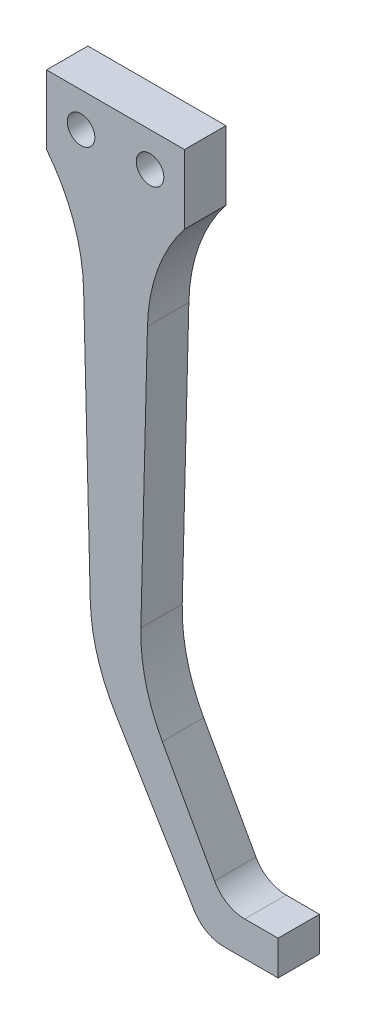
ISO-10303-21;
HEADER;
FILE_DESCRIPTION(('STEP AP214'),'2;1');
FILE_NAME('part.step','',(''),(''),'','','');
FILE_SCHEMA(('AUTOMOTIVE_DESIGN { 1 0 10303 214 1 1 1 1 }'));
ENDSEC;
DATA;
#1=APPLICATION_CONTEXT('core data for automotive mechanical design processes');
#2=APPLICATION_PROTOCOL_DEFINITION('international standard','automotive_design',2000,#1);
#3=PRODUCT_CONTEXT('',#1,'mechanical');
#4=PRODUCT('Part','Part','',(#3));
#5=PRODUCT_RELATED_PRODUCT_CATEGORY('part','',(#4));
#6=PRODUCT_DEFINITION_FORMATION('','',#4);
#7=PRODUCT_DEFINITION_CONTEXT('part definition',#1,'design');
#8=PRODUCT_DEFINITION('design','',#6,#7);
#9=PRODUCT_DEFINITION_SHAPE('','',#8);
#10=(LENGTH_UNIT() NAMED_UNIT(*) SI_UNIT(.MILLI.,.METRE.));
#11=(NAMED_UNIT(*) PLANE_ANGLE_UNIT() SI_UNIT($,.RADIAN.));
#12=(NAMED_UNIT(*) SI_UNIT($,.STERADIAN.) SOLID_ANGLE_UNIT());
#13=UNCERTAINTY_MEASURE_WITH_UNIT(LENGTH_MEASURE(1.E-05),#10,'distance_accuracy_value','');
#14=(GEOMETRIC_REPRESENTATION_CONTEXT(3) GLOBAL_UNCERTAINTY_ASSIGNED_CONTEXT((#13)) GLOBAL_UNIT_ASSIGNED_CONTEXT((#10,
#11,#12)) REPRESENTATION_CONTEXT('',''));
#15=CARTESIAN_POINT('',(0.,0.,0.));
#16=DIRECTION('',(0.,0.,1.));
#17=DIRECTION('',(1.,0.,0.));
#18=AXIS2_PLACEMENT_3D('',#15,#16,#17);
#19=CARTESIAN_POINT('',(0.,-87.2307621135331,6.));
#20=DIRECTION('',(0.,-1.,0.));
#21=DIRECTION('',(0.,0.,-1.));
#22=AXIS2_PLACEMENT_3D('',#19,#20,#21);
#23=PLANE('',#22);
#24=DIRECTION('',(-1.,0.,0.));
#25=VECTOR('',#24,1.);
#26=CARTESIAN_POINT('',(0.,-87.2307621135331,0.));
#27=LINE('',#26,#25);
#28=CARTESIAN_POINT('',(23.5614097231523,-87.2307621135331,0.));
#29=VERTEX_POINT('',#28);
#30=CARTESIAN_POINT('',(18.7334333782825,-87.2307621135331,0.));
#31=VERTEX_POINT('',#30);
#32=EDGE_CURVE('E228',#29,#31,#27,.T.);
#33=ORIENTED_EDGE('',*,*,#32,.T.);
#34=DIRECTION('',(0.,0.,-1.));
#35=VECTOR('',#34,1.);
#36=CARTESIAN_POINT('',(18.7334333782825,-87.2307621135331,6.));
#37=LINE('',#36,#35);
#38=CARTESIAN_POINT('',(18.7334333782825,-87.2307621135331,6.));
#39=VERTEX_POINT('',#38);
#40=EDGE_CURVE('E56',#31,#39,#37,.F.);
#41=ORIENTED_EDGE('',*,*,#40,.T.);
#42=DIRECTION('',(-1.,0.,0.));
#43=VECTOR('',#42,1.);
#44=CARTESIAN_POINT('',(0.,-87.2307621135331,6.));
#45=LINE('',#44,#43);
#46=CARTESIAN_POINT('',(23.5614097231523,-87.2307621135331,6.));
#47=VERTEX_POINT('',#46);
#48=EDGE_CURVE('E241',#47,#39,#45,.T.);
#49=ORIENTED_EDGE('',*,*,#48,.F.);
#50=DIRECTION('',(0.,0.,-1.));
#51=VECTOR('',#50,1.);
#52=CARTESIAN_POINT('',(23.5614097231523,-87.2307621135331,6.));
#53=LINE('',#52,#51);
#54=EDGE_CURVE('E234',#47,#29,#53,.T.);
#55=ORIENTED_EDGE('',*,*,#54,.T.);
#56=EDGE_LOOP('',(#33,#41,#49,#55));
#57=FACE_BOUND('',#56,.T.);
#58=ADVANCED_FACE('F35',(#57),#23,.F.);
#59=CARTESIAN_POINT('',(-24.8338215038537,-13.7220093127288,6.));
#60=DIRECTION('',(-0.875270549868654,-0.483633605669234,0.));
#61=DIRECTION('',(0.483633605669234,-0.875270549868654,0.));
#62=AXIS2_PLACEMENT_3D('',#59,#60,#61);
#63=PLANE('',#62);
#64=DIRECTION('',(-0.483633605669234,0.875270549868654,0.));
#65=VECTOR('',#64,1.);
#66=CARTESIAN_POINT('',(-24.8338215038537,-13.7220093127288,6.));
#67=LINE('',#66,#65);
#68=CARTESIAN_POINT('',(14.3570806289393,-84.6489301418793,6.));
#69=VERTEX_POINT('',#68);
#70=CARTESIAN_POINT('',(6.77992016762672,-70.9359347551364,6.));
#71=VERTEX_POINT('',#70);
#72=EDGE_CURVE('E238',#69,#71,#67,.T.);
#73=ORIENTED_EDGE('',*,*,#72,.F.);
#74=DIRECTION('',(0.,0.,-1.));
#75=VECTOR('',#74,1.);
#76=CARTESIAN_POINT('',(14.3570806289393,-84.6489301418793,0.));
#77=LINE('',#76,#75);
#78=CARTESIAN_POINT('',(14.3570806289393,-84.6489301418793,0.));
#79=VERTEX_POINT('',#78);
#80=EDGE_CURVE('E218',#69,#79,#77,.T.);
#81=ORIENTED_EDGE('',*,*,#80,.T.);
#82=DIRECTION('',(-0.483633605669234,0.875270549868654,0.));
#83=VECTOR('',#82,1.);
#84=CARTESIAN_POINT('',(-24.8338215038537,-13.7220093127288,0.));
#85=LINE('',#84,#83);
#86=CARTESIAN_POINT('',(6.77992016762672,-70.9359347551364,0.));
#87=VERTEX_POINT('',#86);
#88=EDGE_CURVE('E229',#79,#87,#85,.T.);
#89=ORIENTED_EDGE('',*,*,#88,.T.);
#90=DIRECTION('',(0.,0.,-1.));
#91=VECTOR('',#90,1.);
#92=CARTESIAN_POINT('',(6.77992016762672,-70.9359347551363,6.));
#93=LINE('',#92,#91);
#94=EDGE_CURVE('E197',#87,#71,#93,.F.);
#95=ORIENTED_EDGE('',*,*,#94,.T.);
#96=EDGE_LOOP('',(#73,#81,#89,#95));
#97=FACE_BOUND('',#96,.T.);
#98=ADVANCED_FACE('F237',(#97),#63,.F.);
#99=CARTESIAN_POINT('',(5.12179887570269,-0.128044971892567,6.));
#100=DIRECTION('',(-0.999687646408123,0.0249921911602029,0.));
#101=DIRECTION('',(-0.024992191160203,-0.999687646408123,0.));
#102=AXIS2_PLACEMENT_3D('',#99,#100,#101);
#103=PLANE('',#102);
#104=DIRECTION('',(0.024992191160203,0.999687646408123,0.));
#105=VECTOR('',#104,1.);
#106=CARTESIAN_POINT('',(5.12179887570269,-0.128044971892567,0.));
#107=LINE('',#106,#105);
#108=CARTESIAN_POINT('',(3.66949275414,-58.2202898344005,0.));
#109=VERTEX_POINT('',#108);
#110=CARTESIAN_POINT('',(4.62829222900821,-19.8683108396716,0.));
#111=VERTEX_POINT('',#110);
#112=EDGE_CURVE('E266',#109,#111,#107,.T.);
#113=ORIENTED_EDGE('',*,*,#112,.T.);
#114=DIRECTION('',(0.,0.,-1.));
#115=VECTOR('',#114,1.);
#116=CARTESIAN_POINT('',(4.62829222900821,-19.8683108396716,6.));
#117=LINE('',#116,#115);
#118=CARTESIAN_POINT('',(4.62829222900821,-19.8683108396716,6.));
#119=VERTEX_POINT('',#118);
#120=EDGE_CURVE('E177',#111,#119,#117,.F.);
#121=ORIENTED_EDGE('',*,*,#120,.T.);
#122=DIRECTION('',(0.024992191160203,0.999687646408123,0.));
#123=VECTOR('',#122,1.);
#124=CARTESIAN_POINT('',(5.12179887570269,-0.128044971892567,6.));
#125=LINE('',#124,#123);
#126=CARTESIAN_POINT('',(3.66949275414,-58.2202898344005,6.));
#127=VERTEX_POINT('',#126);
#128=EDGE_CURVE('E157',#127,#119,#125,.T.);
#129=ORIENTED_EDGE('',*,*,#128,.F.);
#130=DIRECTION('',(0.,0.,-1.));
#131=VECTOR('',#130,1.);
#132=CARTESIAN_POINT('',(3.66949275414,-58.2202898344004,0.));
#133=LINE('',#132,#131);
#134=EDGE_CURVE('E174',#127,#109,#133,.T.);
#135=ORIENTED_EDGE('',*,*,#134,.T.);
#136=EDGE_LOOP('',(#113,#121,#129,#135));
#137=FACE_BOUND('',#136,.T.);
#138=ADVANCED_FACE('F308',(#137),#103,.F.);
#139=CARTESIAN_POINT('',(10.,0.,6.));
#140=DIRECTION('',(1.,0.,0.));
#141=DIRECTION('',(0.,1.,0.));
#142=AXIS2_PLACEMENT_3D('',#139,#140,#141);
#143=PLANE('',#142);
#144=DIRECTION('',(0.,-1.,0.));
#145=VECTOR('',#144,1.);
#146=CARTESIAN_POINT('',(10.,0.,0.));
#147=LINE('',#146,#145);
#148=CARTESIAN_POINT('',(10.,5.,0.));
#149=VERTEX_POINT('',#148);
#150=CARTESIAN_POINT('',(10.,-5.,0.));
#151=VERTEX_POINT('',#150);
#152=EDGE_CURVE('E269',#149,#151,#147,.T.);
#153=ORIENTED_EDGE('',*,*,#152,.F.);
#154=DIRECTION('',(0.,0.,-1.));
#155=VECTOR('',#154,1.);
#156=CARTESIAN_POINT('',(10.,5.,6.));
#157=LINE('',#156,#155);
#158=CARTESIAN_POINT('',(10.,5.,6.));
#159=VERTEX_POINT('',#158);
#160=EDGE_CURVE('E170',#159,#149,#157,.T.);
#161=ORIENTED_EDGE('',*,*,#160,.F.);
#162=DIRECTION('',(0.,-1.,0.));
#163=VECTOR('',#162,1.);
#164=CARTESIAN_POINT('',(10.,0.,6.));
#165=LINE('',#164,#163);
#166=CARTESIAN_POINT('',(10.,-5.,6.));
#167=VERTEX_POINT('',#166);
#168=EDGE_CURVE('E154',#159,#167,#165,.T.);
#169=ORIENTED_EDGE('',*,*,#168,.T.);
#170=DIRECTION('',(0.,0.,-1.));
#171=VECTOR('',#170,1.);
#172=CARTESIAN_POINT('',(10.,-5.,6.));
#173=LINE('',#172,#171);
#174=EDGE_CURVE('E168',#167,#151,#173,.T.);
#175=ORIENTED_EDGE('',*,*,#174,.T.);
#176=EDGE_LOOP('',(#153,#161,#169,#175));
#177=FACE_BOUND('',#176,.T.);
#178=ADVANCED_FACE('F167',(#177),#143,.T.);
#179=CARTESIAN_POINT('',(0.,5.,6.));
#180=DIRECTION('',(0.,1.,0.));
#181=DIRECTION('',(0.,0.,1.));
#182=AXIS2_PLACEMENT_3D('',#179,#180,#181);
#183=PLANE('',#182);
#184=DIRECTION('',(1.,0.,0.));
#185=VECTOR('',#184,1.);
#186=CARTESIAN_POINT('',(0.,5.,0.));
#187=LINE('',#186,#185);
#188=CARTESIAN_POINT('',(-10.,5.,0.));
#189=VERTEX_POINT('',#188);
#190=EDGE_CURVE('E271',#189,#149,#187,.T.);
#191=ORIENTED_EDGE('',*,*,#190,.F.);
#192=DIRECTION('',(0.,0.,-1.));
#193=VECTOR('',#192,1.);
#194=CARTESIAN_POINT('',(-10.,5.,6.));
#195=LINE('',#194,#193);
#196=CARTESIAN_POINT('',(-10.,5.,6.));
#197=VERTEX_POINT('',#196);
#198=EDGE_CURVE('E179',#197,#189,#195,.T.);
#199=ORIENTED_EDGE('',*,*,#198,.F.);
#200=DIRECTION('',(1.,0.,0.));
#201=VECTOR('',#200,1.);
#202=CARTESIAN_POINT('',(0.,5.,6.));
#203=LINE('',#202,#201);
#204=EDGE_CURVE('E171',#197,#159,#203,.T.);
#205=ORIENTED_EDGE('',*,*,#204,.T.);
#206=ORIENTED_EDGE('',*,*,#160,.T.);
#207=EDGE_LOOP('',(#191,#199,#205,#206));
#208=FACE_BOUND('',#207,.T.);
#209=ADVANCED_FACE('F305',(#208),#183,.T.);
#210=CARTESIAN_POINT('',(-10.,0.,6.));
#211=DIRECTION('',(1.,0.,0.));
#212=DIRECTION('',(0.,1.,0.));
#213=AXIS2_PLACEMENT_3D('',#210,#211,#212);
#214=PLANE('',#213);
#215=DIRECTION('',(0.,-1.,0.));
#216=VECTOR('',#215,1.);
#217=CARTESIAN_POINT('',(-10.,0.,0.));
#218=LINE('',#217,#216);
#219=CARTESIAN_POINT('',(-10.,-5.,0.));
#220=VERTEX_POINT('',#219);
#221=EDGE_CURVE('E274',#189,#220,#218,.T.);
#222=ORIENTED_EDGE('',*,*,#221,.T.);
#223=DIRECTION('',(0.,0.,-1.));
#224=VECTOR('',#223,1.);
#225=CARTESIAN_POINT('',(-10.,-5.,6.));
#226=LINE('',#225,#224);
#227=CARTESIAN_POINT('',(-10.,-5.,6.));
#228=VERTEX_POINT('',#227);
#229=EDGE_CURVE('E295',#228,#220,#226,.T.);
#230=ORIENTED_EDGE('',*,*,#229,.F.);
#231=DIRECTION('',(0.,-1.,0.));
#232=VECTOR('',#231,1.);
#233=CARTESIAN_POINT('',(-10.,0.,6.));
#234=LINE('',#233,#232);
#235=EDGE_CURVE('E248',#197,#228,#234,.T.);
#236=ORIENTED_EDGE('',*,*,#235,.F.);
#237=ORIENTED_EDGE('',*,*,#198,.T.);
#238=EDGE_LOOP('',(#222,#230,#236,#237));
#239=FACE_BOUND('',#238,.T.);
#240=ADVANCED_FACE('F300',(#239),#214,.F.);
#241=CARTESIAN_POINT('',(-5.12179887570269,-0.128044971892568,6.));
#242=DIRECTION('',(0.999687646408123,0.0249921911602032,0.));
#243=DIRECTION('',(-0.0249921911602032,0.999687646408123,0.));
#244=AXIS2_PLACEMENT_3D('',#241,#242,#243);
#245=PLANE('',#244);
#246=DIRECTION('',(0.0249921911602032,-0.999687646408123,0.));
#247=VECTOR('',#246,1.);
#248=CARTESIAN_POINT('',(-5.12179887570269,-0.128044971892568,6.));
#249=LINE('',#248,#247);
#250=CARTESIAN_POINT('',(-4.62829222900821,-19.8683108396716,6.));
#251=VERTEX_POINT('',#250);
#252=CARTESIAN_POINT('',(-3.66465021140004,-58.413991543998,6.));
#253=VERTEX_POINT('',#252);
#254=EDGE_CURVE('E250',#251,#253,#249,.T.);
#255=ORIENTED_EDGE('',*,*,#254,.F.);
#256=DIRECTION('',(0.,0.,-1.));
#257=VECTOR('',#256,1.);
#258=CARTESIAN_POINT('',(-4.62829222900821,-19.8683108396716,6.));
#259=LINE('',#258,#257);
#260=CARTESIAN_POINT('',(-4.62829222900821,-19.8683108396716,0.));
#261=VERTEX_POINT('',#260);
#262=EDGE_CURVE('E186',#251,#261,#259,.T.);
#263=ORIENTED_EDGE('',*,*,#262,.T.);
#264=DIRECTION('',(0.0249921911602032,-0.999687646408123,0.));
#265=VECTOR('',#264,1.);
#266=CARTESIAN_POINT('',(-5.12179887570269,-0.128044971892568,0.));
#267=LINE('',#266,#265);
#268=CARTESIAN_POINT('',(-3.66465021140004,-58.413991543998,0.));
#269=VERTEX_POINT('',#268);
#270=EDGE_CURVE('E277',#261,#269,#267,.T.);
#271=ORIENTED_EDGE('',*,*,#270,.T.);
#272=DIRECTION('',(0.,0.,-1.));
#273=VECTOR('',#272,1.);
#274=CARTESIAN_POINT('',(-3.66465021140004,-58.413991543998,6.));
#275=LINE('',#274,#273);
#276=EDGE_CURVE('E184',#269,#253,#275,.F.);
#277=ORIENTED_EDGE('',*,*,#276,.T.);
#278=EDGE_LOOP('',(#255,#263,#271,#277));
#279=FACE_BOUND('',#278,.T.);
#280=ADVANCED_FACE('F343',(#279),#245,.F.);
#281=CARTESIAN_POINT('',(-31.2473849142956,-18.7443908452629,6.));
#282=DIRECTION('',(-0.857541837332092,-0.514414227277104,0.));
#283=DIRECTION('',(0.514414227277104,-0.857541837332092,0.));
#284=AXIS2_PLACEMENT_3D('',#281,#282,#283);
#285=PLANE('',#284);
#286=DIRECTION('',(-0.514414227277104,0.857541837332092,0.));
#287=VECTOR('',#286,1.);
#288=CARTESIAN_POINT('',(-31.2473849142956,-18.7443908452629,0.));
#289=LINE('',#288,#287);
#290=CARTESIAN_POINT('',(11.3784930893101,-89.8028332499187,0.));
#291=VERTEX_POINT('',#290);
#292=CARTESIAN_POINT('',(-0.111004984499258,-70.6495424469205,0.));
#293=VERTEX_POINT('',#292);
#294=EDGE_CURVE('E280',#291,#293,#289,.T.);
#295=ORIENTED_EDGE('',*,*,#294,.F.);
#296=DIRECTION('',(0.,0.,-1.));
#297=VECTOR('',#296,1.);
#298=CARTESIAN_POINT('',(11.3784930893101,-89.8028332499186,6.));
#299=LINE('',#298,#297);
#300=CARTESIAN_POINT('',(11.3784930893101,-89.8028332499187,6.));
#301=VERTEX_POINT('',#300);
#302=EDGE_CURVE('E214',#291,#301,#299,.F.);
#303=ORIENTED_EDGE('',*,*,#302,.T.);
#304=DIRECTION('',(-0.514414227277104,0.857541837332092,0.));
#305=VECTOR('',#304,1.);
#306=CARTESIAN_POINT('',(-31.2473849142956,-18.7443908452629,6.));
#307=LINE('',#306,#305);
#308=CARTESIAN_POINT('',(-0.111004984499258,-70.6495424469205,6.));
#309=VERTEX_POINT('',#308);
#310=EDGE_CURVE('E253',#301,#309,#307,.T.);
#311=ORIENTED_EDGE('',*,*,#310,.T.);
#312=DIRECTION('',(0.,0.,-1.));
#313=VECTOR('',#312,1.);
#314=CARTESIAN_POINT('',(-0.111004984499265,-70.6495424469205,0.));
#315=LINE('',#314,#313);
#316=EDGE_CURVE('E189',#309,#293,#315,.T.);
#317=ORIENTED_EDGE('',*,*,#316,.T.);
#318=EDGE_LOOP('',(#295,#303,#311,#317));
#319=FACE_BOUND('',#318,.T.);
#320=ADVANCED_FACE('F374',(#319),#285,.T.);
#321=CARTESIAN_POINT('',(0.,-92.2307621135331,6.));
#322=DIRECTION('',(0.,1.,0.));
#323=DIRECTION('',(0.,0.,1.));
#324=AXIS2_PLACEMENT_3D('',#321,#322,#323);
#325=PLANE('',#324);
#326=DIRECTION('',(1.,0.,0.));
#327=VECTOR('',#326,1.);
#328=CARTESIAN_POINT('',(0.,-92.2307621135331,6.));
#329=LINE('',#328,#327);
#330=CARTESIAN_POINT('',(15.6662022759705,-92.2307621135331,6.));
#331=VERTEX_POINT('',#330);
#332=CARTESIAN_POINT('',(23.5614097231523,-92.2307621135331,6.));
#333=VERTEX_POINT('',#332);
#334=EDGE_CURVE('E255',#331,#333,#329,.T.);
#335=ORIENTED_EDGE('',*,*,#334,.F.);
#336=DIRECTION('',(0.,0.,-1.));
#337=VECTOR('',#336,1.);
#338=CARTESIAN_POINT('',(15.6662022759705,-92.2307621135331,0.));
#339=LINE('',#338,#337);
#340=CARTESIAN_POINT('',(15.6662022759705,-92.2307621135331,0.));
#341=VERTEX_POINT('',#340);
#342=EDGE_CURVE('E209',#331,#341,#339,.T.);
#343=ORIENTED_EDGE('',*,*,#342,.T.);
#344=DIRECTION('',(1.,0.,0.));
#345=VECTOR('',#344,1.);
#346=CARTESIAN_POINT('',(0.,-92.2307621135331,0.));
#347=LINE('',#346,#345);
#348=CARTESIAN_POINT('',(23.5614097231523,-92.2307621135331,0.));
#349=VERTEX_POINT('',#348);
#350=EDGE_CURVE('E282',#341,#349,#347,.T.);
#351=ORIENTED_EDGE('',*,*,#350,.T.);
#352=DIRECTION('',(0.,0.,-1.));
#353=VECTOR('',#352,1.);
#354=CARTESIAN_POINT('',(23.5614097231523,-92.2307621135331,6.));
#355=LINE('',#354,#353);
#356=EDGE_CURVE('E292',#333,#349,#355,.T.);
#357=ORIENTED_EDGE('',*,*,#356,.F.);
#358=EDGE_LOOP('',(#335,#343,#351,#357));
#359=FACE_BOUND('',#358,.T.);
#360=ADVANCED_FACE('F353',(#359),#325,.F.);
#361=CARTESIAN_POINT('',(5.,0.,6.));
#362=DIRECTION('',(0.,0.,-1.));
#363=DIRECTION('',(-1.,0.,0.));
#364=AXIS2_PLACEMENT_3D('',#361,#362,#363);
#365=CYLINDRICAL_SURFACE('',#364,2.);
#366=CARTESIAN_POINT('',(5.,0.,6.));
#367=DIRECTION('',(0.,0.,1.));
#368=DIRECTION('',(1.,0.,0.));
#369=AXIS2_PLACEMENT_3D('',#366,#367,#368);
#370=CIRCLE('',#369,2.);
#371=CARTESIAN_POINT('',(7.,0.,6.));
#372=VERTEX_POINT('',#371);
#373=EDGE_CURVE('E259',#372,#372,#370,.T.);
#374=ORIENTED_EDGE('',*,*,#373,.T.);
#375=EDGE_LOOP('',(#374));
#376=FACE_BOUND('',#375,.T.);
#377=CARTESIAN_POINT('',(5.,0.,0.));
#378=DIRECTION('',(0.,0.,1.));
#379=DIRECTION('',(1.,0.,0.));
#380=AXIS2_PLACEMENT_3D('',#377,#378,#379);
#381=CIRCLE('',#380,2.);
#382=CARTESIAN_POINT('',(7.,0.,0.));
#383=VERTEX_POINT('',#382);
#384=EDGE_CURVE('E286',#383,#383,#381,.T.);
#385=ORIENTED_EDGE('',*,*,#384,.F.);
#386=EDGE_LOOP('',(#385));
#387=FACE_BOUND('',#386,.T.);
#388=ADVANCED_FACE('F361',(#376,#387),#365,.F.);
#389=CARTESIAN_POINT('',(23.5614097231523,0.,6.));
#390=DIRECTION('',(-1.,0.,0.));
#391=DIRECTION('',(0.,0.,1.));
#392=AXIS2_PLACEMENT_3D('',#389,#390,#391);
#393=PLANE('',#392);
#394=DIRECTION('',(0.,1.,0.));
#395=VECTOR('',#394,1.);
#396=CARTESIAN_POINT('',(23.5614097231523,0.,0.));
#397=LINE('',#396,#395);
#398=EDGE_CURVE('E284',#349,#29,#397,.T.);
#399=ORIENTED_EDGE('',*,*,#398,.T.);
#400=ORIENTED_EDGE('',*,*,#54,.F.);
#401=DIRECTION('',(0.,1.,0.));
#402=VECTOR('',#401,1.);
#403=CARTESIAN_POINT('',(23.5614097231523,0.,6.));
#404=LINE('',#403,#402);
#405=EDGE_CURVE('E257',#333,#47,#404,.T.);
#406=ORIENTED_EDGE('',*,*,#405,.F.);
#407=ORIENTED_EDGE('',*,*,#356,.T.);
#408=EDGE_LOOP('',(#399,#400,#406,#407));
#409=FACE_BOUND('',#408,.T.);
#410=ADVANCED_FACE('F357',(#409),#393,.F.);
#411=CARTESIAN_POINT('',(-5.,0.,6.));
#412=DIRECTION('',(0.,0.,-1.));
#413=DIRECTION('',(-1.,0.,0.));
#414=AXIS2_PLACEMENT_3D('',#411,#412,#413);
#415=CYLINDRICAL_SURFACE('',#414,2.);
#416=CARTESIAN_POINT('',(-5.,0.,6.));
#417=DIRECTION('',(0.,0.,1.));
#418=DIRECTION('',(1.,0.,0.));
#419=AXIS2_PLACEMENT_3D('',#416,#417,#418);
#420=CIRCLE('',#419,2.);
#421=CARTESIAN_POINT('',(-3.,0.,6.));
#422=VERTEX_POINT('',#421);
#423=EDGE_CURVE('E262',#422,#422,#420,.T.);
#424=ORIENTED_EDGE('',*,*,#423,.T.);
#425=EDGE_LOOP('',(#424));
#426=FACE_BOUND('',#425,.T.);
#427=CARTESIAN_POINT('',(-5.,0.,0.));
#428=DIRECTION('',(0.,0.,1.));
#429=DIRECTION('',(1.,0.,0.));
#430=AXIS2_PLACEMENT_3D('',#427,#428,#429);
#431=CIRCLE('',#430,2.);
#432=CARTESIAN_POINT('',(-3.,0.,0.));
#433=VERTEX_POINT('',#432);
#434=EDGE_CURVE('E244',#433,#433,#431,.T.);
#435=ORIENTED_EDGE('',*,*,#434,.F.);
#436=EDGE_LOOP('',(#435));
#437=FACE_BOUND('',#436,.T.);
#438=ADVANCED_FACE('F360',(#426,#437),#415,.F.);
#439=CARTESIAN_POINT('',(0.,0.,6.));
#440=DIRECTION('',(0.,0.,1.));
#441=DIRECTION('',(1.,0.,0.));
#442=AXIS2_PLACEMENT_3D('',#439,#440,#441);
#443=PLANE('',#442);
#444=ORIENTED_EDGE('',*,*,#310,.F.);
#445=CARTESIAN_POINT('',(15.6662022759705,-87.2307621135331,6.));
#446=DIRECTION('',(0.,0.,1.));
#447=DIRECTION('',(1.,0.,0.));
#448=AXIS2_PLACEMENT_3D('',#445,#446,#447);
#449=CIRCLE('',#448,5.);
#450=EDGE_CURVE('E216',#301,#331,#449,.T.);
#451=ORIENTED_EDGE('',*,*,#450,.T.);
#452=ORIENTED_EDGE('',*,*,#334,.T.);
#453=ORIENTED_EDGE('',*,*,#405,.T.);
#454=ORIENTED_EDGE('',*,*,#48,.T.);
#455=CARTESIAN_POINT('',(18.7334333782825,-82.2307621135331,6.));
#456=DIRECTION('',(0.,0.,1.));
#457=DIRECTION('',(1.,0.,0.));
#458=AXIS2_PLACEMENT_3D('',#455,#456,#457);
#459=CIRCLE('',#458,5.);
#460=EDGE_CURVE('E11',#39,#69,#459,.F.);
#461=ORIENTED_EDGE('',*,*,#460,.T.);
#462=ORIENTED_EDGE('',*,*,#72,.T.);
#463=CARTESIAN_POINT('',(28.6616839143431,-58.8450946134055,6.));
#464=DIRECTION('',(0.,0.,1.));
#465=DIRECTION('',(1.,0.,0.));
#466=AXIS2_PLACEMENT_3D('',#463,#464,#465);
#467=CIRCLE('',#466,25.);
#468=EDGE_CURVE('E207',#71,#127,#467,.F.);
#469=ORIENTED_EDGE('',*,*,#468,.T.);
#470=ORIENTED_EDGE('',*,*,#128,.T.);
#471=CARTESIAN_POINT('',(29.6204833892113,-20.4931156186767,6.));
#472=DIRECTION('',(0.,0.,1.));
#473=DIRECTION('',(1.,0.,0.));
#474=AXIS2_PLACEMENT_3D('',#471,#472,#473);
#475=CIRCLE('',#474,25.);
#476=EDGE_CURVE('E148',#119,#167,#475,.F.);
#477=ORIENTED_EDGE('',*,*,#476,.T.);
#478=ORIENTED_EDGE('',*,*,#168,.F.);
#479=ORIENTED_EDGE('',*,*,#204,.F.);
#480=ORIENTED_EDGE('',*,*,#235,.T.);
#481=CARTESIAN_POINT('',(-29.6204833892113,-20.4931156186767,6.));
#482=DIRECTION('',(0.,0.,1.));
#483=DIRECTION('',(1.,0.,0.));
#484=AXIS2_PLACEMENT_3D('',#481,#482,#483);
#485=CIRCLE('',#484,25.);
#486=EDGE_CURVE('E202',#228,#251,#485,.F.);
#487=ORIENTED_EDGE('',*,*,#486,.T.);
#488=ORIENTED_EDGE('',*,*,#254,.T.);
#489=CARTESIAN_POINT('',(21.327540948803,-57.7891867649929,6.));
#490=DIRECTION('',(0.,0.,1.));
#491=DIRECTION('',(1.,0.,0.));
#492=AXIS2_PLACEMENT_3D('',#489,#490,#491);
#493=CIRCLE('',#492,25.);
#494=EDGE_CURVE('E194',#253,#309,#493,.T.);
#495=ORIENTED_EDGE('',*,*,#494,.T.);
#496=EDGE_LOOP('',(#444,#451,#452,#453,#454,#461,#462,#469,#470,#477,#478,#479,#480,#487,#488,#495));
#497=FACE_BOUND('',#496,.T.);
#498=ORIENTED_EDGE('',*,*,#373,.F.);
#499=EDGE_LOOP('',(#498));
#500=FACE_BOUND('',#499,.T.);
#501=ORIENTED_EDGE('',*,*,#423,.F.);
#502=EDGE_LOOP('',(#501));
#503=FACE_BOUND('',#502,.T.);
#504=ADVANCED_FACE('F151',(#497,#500,#503),#443,.T.);
#505=CARTESIAN_POINT('',(0.,0.,0.));
#506=DIRECTION('',(0.,0.,1.));
#507=DIRECTION('',(1.,0.,0.));
#508=AXIS2_PLACEMENT_3D('',#505,#506,#507);
#509=PLANE('',#508);
#510=ORIENTED_EDGE('',*,*,#350,.F.);
#511=CARTESIAN_POINT('',(15.6662022759705,-87.2307621135331,0.));
#512=DIRECTION('',(0.,0.,1.));
#513=DIRECTION('',(1.,0.,0.));
#514=AXIS2_PLACEMENT_3D('',#511,#512,#513);
#515=CIRCLE('',#514,5.);
#516=EDGE_CURVE('E212',#341,#291,#515,.F.);
#517=ORIENTED_EDGE('',*,*,#516,.T.);
#518=ORIENTED_EDGE('',*,*,#294,.T.);
#519=CARTESIAN_POINT('',(21.327540948803,-57.7891867649929,0.));
#520=DIRECTION('',(0.,0.,1.));
#521=DIRECTION('',(1.,0.,0.));
#522=AXIS2_PLACEMENT_3D('',#519,#520,#521);
#523=CIRCLE('',#522,25.);
#524=EDGE_CURVE('E192',#293,#269,#523,.F.);
#525=ORIENTED_EDGE('',*,*,#524,.T.);
#526=ORIENTED_EDGE('',*,*,#270,.F.);
#527=CARTESIAN_POINT('',(-29.6204833892113,-20.4931156186767,0.));
#528=DIRECTION('',(0.,0.,1.));
#529=DIRECTION('',(1.,0.,0.));
#530=AXIS2_PLACEMENT_3D('',#527,#528,#529);
#531=CIRCLE('',#530,25.);
#532=EDGE_CURVE('E161',#261,#220,#531,.T.);
#533=ORIENTED_EDGE('',*,*,#532,.T.);
#534=ORIENTED_EDGE('',*,*,#221,.F.);
#535=ORIENTED_EDGE('',*,*,#190,.T.);
#536=ORIENTED_EDGE('',*,*,#152,.T.);
#537=CARTESIAN_POINT('',(29.6204833892113,-20.4931156186767,0.));
#538=DIRECTION('',(0.,0.,1.));
#539=DIRECTION('',(1.,0.,0.));
#540=AXIS2_PLACEMENT_3D('',#537,#538,#539);
#541=CIRCLE('',#540,25.);
#542=EDGE_CURVE('E162',#151,#111,#541,.T.);
#543=ORIENTED_EDGE('',*,*,#542,.T.);
#544=ORIENTED_EDGE('',*,*,#112,.F.);
#545=CARTESIAN_POINT('',(28.6616839143431,-58.8450946134055,0.));
#546=DIRECTION('',(0.,0.,1.));
#547=DIRECTION('',(1.,0.,0.));
#548=AXIS2_PLACEMENT_3D('',#545,#546,#547);
#549=CIRCLE('',#548,25.);
#550=EDGE_CURVE('E204',#109,#87,#549,.T.);
#551=ORIENTED_EDGE('',*,*,#550,.T.);
#552=ORIENTED_EDGE('',*,*,#88,.F.);
#553=CARTESIAN_POINT('',(18.7334333782825,-82.2307621135331,0.));
#554=DIRECTION('',(0.,0.,1.));
#555=DIRECTION('',(1.,0.,0.));
#556=AXIS2_PLACEMENT_3D('',#553,#554,#555);
#557=CIRCLE('',#556,5.);
#558=EDGE_CURVE('E43',#79,#31,#557,.T.);
#559=ORIENTED_EDGE('',*,*,#558,.T.);
#560=ORIENTED_EDGE('',*,*,#32,.F.);
#561=ORIENTED_EDGE('',*,*,#398,.F.);
#562=EDGE_LOOP('',(#510,#517,#518,#525,#526,#533,#534,#535,#536,#543,#544,#551,#552,#559,#560,#561));
#563=FACE_BOUND('',#562,.T.);
#564=ORIENTED_EDGE('',*,*,#384,.T.);
#565=EDGE_LOOP('',(#564));
#566=FACE_BOUND('',#565,.T.);
#567=ORIENTED_EDGE('',*,*,#434,.T.);
#568=EDGE_LOOP('',(#567));
#569=FACE_BOUND('',#568,.T.);
#570=ADVANCED_FACE('F225',(#563,#566,#569),#509,.F.);
#571=CARTESIAN_POINT('',(29.6204833892113,-20.4931156186767,6.));
#572=DIRECTION('',(0.,0.,-1.));
#573=DIRECTION('',(-1.,0.,0.));
#574=AXIS2_PLACEMENT_3D('',#571,#572,#573);
#575=CYLINDRICAL_SURFACE('',#574,25.);
#576=ORIENTED_EDGE('',*,*,#476,.F.);
#577=ORIENTED_EDGE('',*,*,#120,.F.);
#578=ORIENTED_EDGE('',*,*,#542,.F.);
#579=ORIENTED_EDGE('',*,*,#174,.F.);
#580=EDGE_LOOP('',(#576,#577,#578,#579));
#581=FACE_BOUND('',#580,.T.);
#582=ADVANCED_FACE('F173',(#581),#575,.F.);
#583=CARTESIAN_POINT('',(-29.6204833892113,-20.4931156186767,6.));
#584=DIRECTION('',(0.,0.,-1.));
#585=DIRECTION('',(-1.,0.,0.));
#586=AXIS2_PLACEMENT_3D('',#583,#584,#585);
#587=CYLINDRICAL_SURFACE('',#586,25.);
#588=ORIENTED_EDGE('',*,*,#486,.F.);
#589=ORIENTED_EDGE('',*,*,#229,.T.);
#590=ORIENTED_EDGE('',*,*,#532,.F.);
#591=ORIENTED_EDGE('',*,*,#262,.F.);
#592=EDGE_LOOP('',(#588,#589,#590,#591));
#593=FACE_BOUND('',#592,.T.);
#594=ADVANCED_FACE('F321',(#593),#587,.F.);
#595=CARTESIAN_POINT('',(21.327540948803,-57.7891867649929,6.));
#596=DIRECTION('',(0.,0.,1.));
#597=DIRECTION('',(1.,0.,0.));
#598=AXIS2_PLACEMENT_3D('',#595,#596,#597);
#599=CYLINDRICAL_SURFACE('',#598,25.);
#600=ORIENTED_EDGE('',*,*,#494,.F.);
#601=ORIENTED_EDGE('',*,*,#276,.F.);
#602=ORIENTED_EDGE('',*,*,#524,.F.);
#603=ORIENTED_EDGE('',*,*,#316,.F.);
#604=EDGE_LOOP('',(#600,#601,#602,#603));
#605=FACE_BOUND('',#604,.T.);
#606=ADVANCED_FACE('F314',(#605),#599,.T.);
#607=CARTESIAN_POINT('',(28.6616839143431,-58.8450946134055,6.));
#608=DIRECTION('',(0.,0.,1.));
#609=DIRECTION('',(1.,0.,0.));
#610=AXIS2_PLACEMENT_3D('',#607,#608,#609);
#611=CYLINDRICAL_SURFACE('',#610,25.);
#612=ORIENTED_EDGE('',*,*,#468,.F.);
#613=ORIENTED_EDGE('',*,*,#94,.F.);
#614=ORIENTED_EDGE('',*,*,#550,.F.);
#615=ORIENTED_EDGE('',*,*,#134,.F.);
#616=EDGE_LOOP('',(#612,#613,#614,#615));
#617=FACE_BOUND('',#616,.T.);
#618=ADVANCED_FACE('F311',(#617),#611,.F.);
#619=CARTESIAN_POINT('',(15.6662022759705,-87.2307621135331,6.));
#620=DIRECTION('',(0.,0.,1.));
#621=DIRECTION('',(1.,0.,0.));
#622=AXIS2_PLACEMENT_3D('',#619,#620,#621);
#623=CYLINDRICAL_SURFACE('',#622,5.);
#624=ORIENTED_EDGE('',*,*,#450,.F.);
#625=ORIENTED_EDGE('',*,*,#302,.F.);
#626=ORIENTED_EDGE('',*,*,#516,.F.);
#627=ORIENTED_EDGE('',*,*,#342,.F.);
#628=EDGE_LOOP('',(#624,#625,#626,#627));
#629=FACE_BOUND('',#628,.T.);
#630=ADVANCED_FACE('F313',(#629),#623,.T.);
#631=CARTESIAN_POINT('',(18.7334333782825,-82.2307621135331,6.));
#632=DIRECTION('',(0.,0.,1.));
#633=DIRECTION('',(1.,0.,0.));
#634=AXIS2_PLACEMENT_3D('',#631,#632,#633);
#635=CYLINDRICAL_SURFACE('',#634,5.);
#636=ORIENTED_EDGE('',*,*,#460,.F.);
#637=ORIENTED_EDGE('',*,*,#40,.F.);
#638=ORIENTED_EDGE('',*,*,#558,.F.);
#639=ORIENTED_EDGE('',*,*,#80,.F.);
#640=EDGE_LOOP('',(#636,#637,#638,#639));
#641=FACE_BOUND('',#640,.T.);
#642=ADVANCED_FACE('F37',(#641),#635,.F.);
#643=CLOSED_SHELL('',(#58,#98,#138,#178,#209,#240,#280,#320,#360,#388,#410,#438,#504,#570,#582,
#594,#606,#618,#630,#642));
#644=MANIFOLD_SOLID_BREP('B2',#643);
#645=ADVANCED_BREP_SHAPE_REPRESENTATION('',(#18,#644),#14);
#646=SHAPE_DEFINITION_REPRESENTATION(#9,#645);
ENDSEC;
END-ISO-10303-21;
